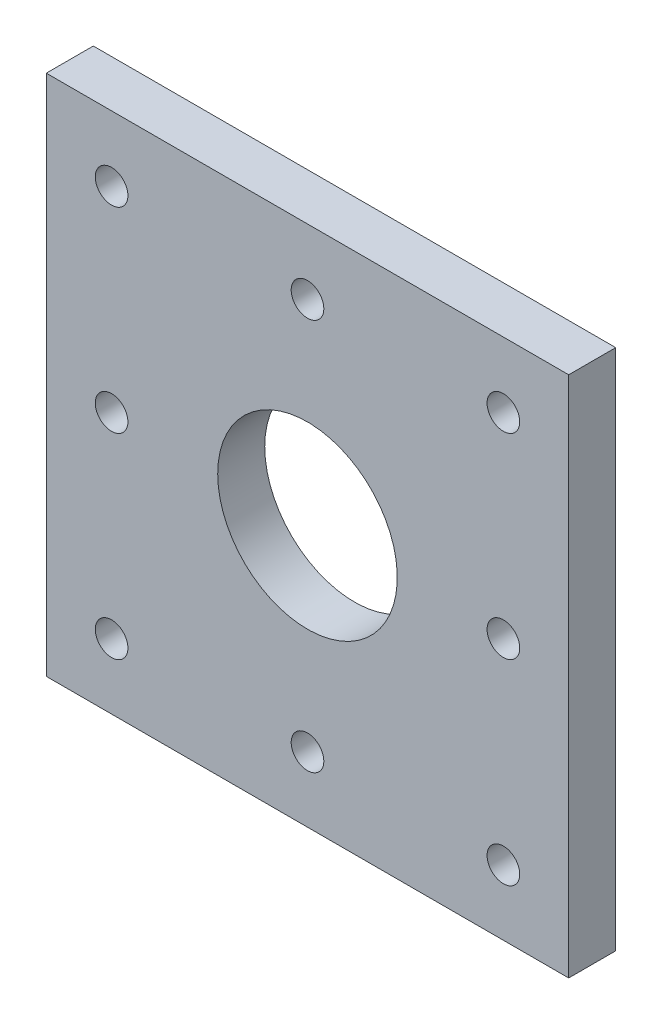
ISO-10303-21;
HEADER;
FILE_DESCRIPTION(('STEP AP214'),'2;1');
FILE_NAME('part.step','',(''),(''),'','','');
FILE_SCHEMA(('AUTOMOTIVE_DESIGN { 1 0 10303 214 1 1 1 1 }'));
ENDSEC;
DATA;
#1=APPLICATION_CONTEXT('core data for automotive mechanical design processes');
#2=APPLICATION_PROTOCOL_DEFINITION('international standard','automotive_design',2000,#1);
#3=PRODUCT_CONTEXT('',#1,'mechanical');
#4=PRODUCT('Part','Part','',(#3));
#5=PRODUCT_RELATED_PRODUCT_CATEGORY('part','',(#4));
#6=PRODUCT_DEFINITION_FORMATION('','',#4);
#7=PRODUCT_DEFINITION_CONTEXT('part definition',#1,'design');
#8=PRODUCT_DEFINITION('design','',#6,#7);
#9=PRODUCT_DEFINITION_SHAPE('','',#8);
#10=(LENGTH_UNIT() NAMED_UNIT(*) SI_UNIT(.MILLI.,.METRE.));
#11=(NAMED_UNIT(*) PLANE_ANGLE_UNIT() SI_UNIT($,.RADIAN.));
#12=(NAMED_UNIT(*) SI_UNIT($,.STERADIAN.) SOLID_ANGLE_UNIT());
#13=UNCERTAINTY_MEASURE_WITH_UNIT(LENGTH_MEASURE(1.E-05),#10,'distance_accuracy_value','');
#14=(GEOMETRIC_REPRESENTATION_CONTEXT(3) GLOBAL_UNCERTAINTY_ASSIGNED_CONTEXT((#13)) GLOBAL_UNIT_ASSIGNED_CONTEXT((#10,
#11,#12)) REPRESENTATION_CONTEXT('',''));
#15=CARTESIAN_POINT('',(0.,0.,0.));
#16=DIRECTION('',(0.,0.,1.));
#17=DIRECTION('',(1.,0.,0.));
#18=AXIS2_PLACEMENT_3D('',#15,#16,#17);
#19=CARTESIAN_POINT('',(0.,0.,4.572));
#20=DIRECTION('',(1.,0.,0.));
#21=DIRECTION('',(0.,1.,0.));
#22=AXIS2_PLACEMENT_3D('',#19,#20,#21);
#23=PLANE('',#22);
#24=DIRECTION('',(0.,-1.,0.));
#25=VECTOR('',#24,1.);
#26=CARTESIAN_POINT('',(0.,0.,0.));
#27=LINE('',#26,#25);
#28=CARTESIAN_POINT('',(0.,50.8,0.));
#29=VERTEX_POINT('',#28);
#30=CARTESIAN_POINT('',(0.,0.,0.));
#31=VERTEX_POINT('',#30);
#32=EDGE_CURVE('E98',#29,#31,#27,.T.);
#33=ORIENTED_EDGE('',*,*,#32,.T.);
#34=DIRECTION('',(0.,0.,-1.));
#35=VECTOR('',#34,1.);
#36=CARTESIAN_POINT('',(0.,0.,4.572));
#37=LINE('',#36,#35);
#38=CARTESIAN_POINT('',(0.,0.,4.572));
#39=VERTEX_POINT('',#38);
#40=EDGE_CURVE('E11',#39,#31,#37,.T.);
#41=ORIENTED_EDGE('',*,*,#40,.F.);
#42=DIRECTION('',(0.,-1.,0.));
#43=VECTOR('',#42,1.);
#44=CARTESIAN_POINT('',(0.,0.,4.572));
#45=LINE('',#44,#43);
#46=CARTESIAN_POINT('',(0.,50.8,4.572));
#47=VERTEX_POINT('',#46);
#48=EDGE_CURVE('E86',#47,#39,#45,.T.);
#49=ORIENTED_EDGE('',*,*,#48,.F.);
#50=DIRECTION('',(0.,0.,-1.));
#51=VECTOR('',#50,1.);
#52=CARTESIAN_POINT('',(0.,50.8,4.572));
#53=LINE('',#52,#51);
#54=EDGE_CURVE('E94',#47,#29,#53,.T.);
#55=ORIENTED_EDGE('',*,*,#54,.T.);
#56=EDGE_LOOP('',(#33,#41,#49,#55));
#57=FACE_BOUND('',#56,.T.);
#58=ADVANCED_FACE('F35',(#57),#23,.F.);
#59=CARTESIAN_POINT('',(0.,0.,4.572));
#60=DIRECTION('',(0.,1.,0.));
#61=DIRECTION('',(0.,0.,1.));
#62=AXIS2_PLACEMENT_3D('',#59,#60,#61);
#63=PLANE('',#62);
#64=DIRECTION('',(1.,0.,0.));
#65=VECTOR('',#64,1.);
#66=CARTESIAN_POINT('',(0.,0.,0.));
#67=LINE('',#66,#65);
#68=CARTESIAN_POINT('',(50.8,0.,0.));
#69=VERTEX_POINT('',#68);
#70=EDGE_CURVE('E90',#31,#69,#67,.T.);
#71=ORIENTED_EDGE('',*,*,#70,.T.);
#72=DIRECTION('',(0.,0.,-1.));
#73=VECTOR('',#72,1.);
#74=CARTESIAN_POINT('',(50.8,0.,4.572));
#75=LINE('',#74,#73);
#76=CARTESIAN_POINT('',(50.8,0.,4.572));
#77=VERTEX_POINT('',#76);
#78=EDGE_CURVE('E43',#77,#69,#75,.T.);
#79=ORIENTED_EDGE('',*,*,#78,.F.);
#80=DIRECTION('',(1.,0.,0.));
#81=VECTOR('',#80,1.);
#82=CARTESIAN_POINT('',(0.,0.,4.572));
#83=LINE('',#82,#81);
#84=EDGE_CURVE('E81',#39,#77,#83,.T.);
#85=ORIENTED_EDGE('',*,*,#84,.F.);
#86=ORIENTED_EDGE('',*,*,#40,.T.);
#87=EDGE_LOOP('',(#71,#79,#85,#86));
#88=FACE_BOUND('',#87,.T.);
#89=ADVANCED_FACE('F89',(#88),#63,.F.);
#90=CARTESIAN_POINT('',(50.8,0.,4.572));
#91=DIRECTION('',(-1.,0.,0.));
#92=DIRECTION('',(0.,-1.,0.));
#93=AXIS2_PLACEMENT_3D('',#90,#91,#92);
#94=PLANE('',#93);
#95=DIRECTION('',(0.,1.,0.));
#96=VECTOR('',#95,1.);
#97=CARTESIAN_POINT('',(50.8,0.,0.));
#98=LINE('',#97,#96);
#99=CARTESIAN_POINT('',(50.8,50.8,0.));
#100=VERTEX_POINT('',#99);
#101=EDGE_CURVE('E68',#69,#100,#98,.T.);
#102=ORIENTED_EDGE('',*,*,#101,.T.);
#103=DIRECTION('',(0.,0.,-1.));
#104=VECTOR('',#103,1.);
#105=CARTESIAN_POINT('',(50.8,50.8,4.572));
#106=LINE('',#105,#104);
#107=CARTESIAN_POINT('',(50.8,50.8,4.572));
#108=VERTEX_POINT('',#107);
#109=EDGE_CURVE('E91',#108,#100,#106,.T.);
#110=ORIENTED_EDGE('',*,*,#109,.F.);
#111=DIRECTION('',(0.,1.,0.));
#112=VECTOR('',#111,1.);
#113=CARTESIAN_POINT('',(50.8,0.,4.572));
#114=LINE('',#113,#112);
#115=EDGE_CURVE('E84',#77,#108,#114,.T.);
#116=ORIENTED_EDGE('',*,*,#115,.F.);
#117=ORIENTED_EDGE('',*,*,#78,.T.);
#118=EDGE_LOOP('',(#102,#110,#116,#117));
#119=FACE_BOUND('',#118,.T.);
#120=ADVANCED_FACE('F92',(#119),#94,.F.);
#121=CARTESIAN_POINT('',(0.,50.8,4.572));
#122=DIRECTION('',(0.,-1.,0.));
#123=DIRECTION('',(0.,0.,-1.));
#124=AXIS2_PLACEMENT_3D('',#121,#122,#123);
#125=PLANE('',#124);
#126=DIRECTION('',(-1.,0.,0.));
#127=VECTOR('',#126,1.);
#128=CARTESIAN_POINT('',(0.,50.8,0.));
#129=LINE('',#128,#127);
#130=EDGE_CURVE('E74',#100,#29,#129,.T.);
#131=ORIENTED_EDGE('',*,*,#130,.T.);
#132=ORIENTED_EDGE('',*,*,#54,.F.);
#133=DIRECTION('',(-1.,0.,0.));
#134=VECTOR('',#133,1.);
#135=CARTESIAN_POINT('',(0.,50.8,4.572));
#136=LINE('',#135,#134);
#137=EDGE_CURVE('E51',#108,#47,#136,.T.);
#138=ORIENTED_EDGE('',*,*,#137,.F.);
#139=ORIENTED_EDGE('',*,*,#109,.T.);
#140=EDGE_LOOP('',(#131,#132,#138,#139));
#141=FACE_BOUND('',#140,.T.);
#142=ADVANCED_FACE('F106',(#141),#125,.F.);
#143=CARTESIAN_POINT('',(0.,50.8,4.572));
#144=DIRECTION('',(0.,0.,-1.));
#145=DIRECTION('',(-1.,0.,0.));
#146=AXIS2_PLACEMENT_3D('',#143,#144,#145);
#147=PLANE('',#146);
#148=CARTESIAN_POINT('',(6.34999999999961,44.4500000000001,4.572));
#149=DIRECTION('',(0.,0.,-1.));
#150=DIRECTION('',(-1.,0.,0.));
#151=AXIS2_PLACEMENT_3D('',#148,#149,#150);
#152=CIRCLE('',#151,1.58749999999905);
#153=CARTESIAN_POINT('',(4.76250000000056,44.4500000000001,4.572));
#154=VERTEX_POINT('',#153);
#155=EDGE_CURVE('E157',#154,#154,#152,.T.);
#156=ORIENTED_EDGE('',*,*,#155,.T.);
#157=EDGE_LOOP('',(#156));
#158=FACE_BOUND('',#157,.T.);
#159=CARTESIAN_POINT('',(44.4499999999996,44.4500000000001,4.572));
#160=DIRECTION('',(0.,0.,-1.));
#161=DIRECTION('',(-1.,0.,0.));
#162=AXIS2_PLACEMENT_3D('',#159,#160,#161);
#163=CIRCLE('',#162,1.58749999999929);
#164=CARTESIAN_POINT('',(42.8625000000003,44.4500000000001,4.572));
#165=VERTEX_POINT('',#164);
#166=EDGE_CURVE('E151',#165,#165,#163,.T.);
#167=ORIENTED_EDGE('',*,*,#166,.T.);
#168=EDGE_LOOP('',(#167));
#169=FACE_BOUND('',#168,.T.);
#170=CARTESIAN_POINT('',(44.4499999999981,6.35000000000019,4.572));
#171=DIRECTION('',(0.,0.,-1.));
#172=DIRECTION('',(-1.,0.,0.));
#173=AXIS2_PLACEMENT_3D('',#170,#171,#172);
#174=CIRCLE('',#173,1.58749999999839);
#175=CARTESIAN_POINT('',(42.8624999999998,6.35000000000019,4.572));
#176=VERTEX_POINT('',#175);
#177=EDGE_CURVE('E145',#176,#176,#174,.T.);
#178=ORIENTED_EDGE('',*,*,#177,.T.);
#179=EDGE_LOOP('',(#178));
#180=FACE_BOUND('',#179,.T.);
#181=CARTESIAN_POINT('',(6.34999999999961,6.35000000000011,4.572));
#182=DIRECTION('',(0.,0.,-1.));
#183=DIRECTION('',(-1.,0.,0.));
#184=AXIS2_PLACEMENT_3D('',#181,#182,#183);
#185=CIRCLE('',#184,1.58749999999927);
#186=CARTESIAN_POINT('',(4.76250000000034,6.35000000000011,4.572));
#187=VERTEX_POINT('',#186);
#188=EDGE_CURVE('E139',#187,#187,#185,.T.);
#189=ORIENTED_EDGE('',*,*,#188,.T.);
#190=EDGE_LOOP('',(#189));
#191=FACE_BOUND('',#190,.T.);
#192=CARTESIAN_POINT('',(44.45,25.4,4.572));
#193=DIRECTION('',(0.,0.,1.));
#194=DIRECTION('',(1.,0.,0.));
#195=AXIS2_PLACEMENT_3D('',#192,#193,#194);
#196=CIRCLE('',#195,1.5875);
#197=CARTESIAN_POINT('',(46.0375,25.4,4.572));
#198=VERTEX_POINT('',#197);
#199=EDGE_CURVE('E136',#198,#198,#196,.T.);
#200=ORIENTED_EDGE('',*,*,#199,.F.);
#201=EDGE_LOOP('',(#200));
#202=FACE_BOUND('',#201,.T.);
#203=CARTESIAN_POINT('',(25.4,44.45,4.572));
#204=DIRECTION('',(0.,0.,1.));
#205=DIRECTION('',(1.,0.,0.));
#206=AXIS2_PLACEMENT_3D('',#203,#204,#205);
#207=CIRCLE('',#206,1.5875);
#208=CARTESIAN_POINT('',(26.9875,44.45,4.572));
#209=VERTEX_POINT('',#208);
#210=EDGE_CURVE('E130',#209,#209,#207,.T.);
#211=ORIENTED_EDGE('',*,*,#210,.F.);
#212=EDGE_LOOP('',(#211));
#213=FACE_BOUND('',#212,.T.);
#214=CARTESIAN_POINT('',(6.35,25.4,4.572));
#215=DIRECTION('',(0.,0.,1.));
#216=DIRECTION('',(1.,0.,0.));
#217=AXIS2_PLACEMENT_3D('',#214,#215,#216);
#218=CIRCLE('',#217,1.5875);
#219=CARTESIAN_POINT('',(7.9375,25.4,4.572));
#220=VERTEX_POINT('',#219);
#221=EDGE_CURVE('E124',#220,#220,#218,.T.);
#222=ORIENTED_EDGE('',*,*,#221,.F.);
#223=EDGE_LOOP('',(#222));
#224=FACE_BOUND('',#223,.T.);
#225=CARTESIAN_POINT('',(25.4,6.35,4.572));
#226=DIRECTION('',(0.,0.,1.));
#227=DIRECTION('',(1.,0.,0.));
#228=AXIS2_PLACEMENT_3D('',#225,#226,#227);
#229=CIRCLE('',#228,1.5875);
#230=CARTESIAN_POINT('',(26.9875,6.35,4.572));
#231=VERTEX_POINT('',#230);
#232=EDGE_CURVE('E118',#231,#231,#229,.T.);
#233=ORIENTED_EDGE('',*,*,#232,.F.);
#234=EDGE_LOOP('',(#233));
#235=FACE_BOUND('',#234,.T.);
#236=CARTESIAN_POINT('',(25.4,25.4,4.572));
#237=DIRECTION('',(0.,0.,-1.));
#238=DIRECTION('',(-1.,0.,0.));
#239=AXIS2_PLACEMENT_3D('',#236,#237,#238);
#240=CIRCLE('',#239,8.73125);
#241=CARTESIAN_POINT('',(16.66875,25.4,4.572));
#242=VERTEX_POINT('',#241);
#243=EDGE_CURVE('E101',#242,#242,#240,.T.);
#244=ORIENTED_EDGE('',*,*,#243,.T.);
#245=EDGE_LOOP('',(#244));
#246=FACE_BOUND('',#245,.T.);
#247=ORIENTED_EDGE('',*,*,#48,.T.);
#248=ORIENTED_EDGE('',*,*,#84,.T.);
#249=ORIENTED_EDGE('',*,*,#115,.T.);
#250=ORIENTED_EDGE('',*,*,#137,.T.);
#251=EDGE_LOOP('',(#247,#248,#249,#250));
#252=FACE_BOUND('',#251,.T.);
#253=ADVANCED_FACE('F82',(#158,#169,#180,#191,#202,#213,#224,#235,#246,#252),#147,.F.);
#254=CARTESIAN_POINT('',(0.,50.8,0.));
#255=DIRECTION('',(0.,0.,-1.));
#256=DIRECTION('',(-1.,0.,0.));
#257=AXIS2_PLACEMENT_3D('',#254,#255,#256);
#258=PLANE('',#257);
#259=CARTESIAN_POINT('',(6.34999999999961,44.4500000000001,0.));
#260=DIRECTION('',(0.,0.,-1.));
#261=DIRECTION('',(-1.,0.,0.));
#262=AXIS2_PLACEMENT_3D('',#259,#260,#261);
#263=CIRCLE('',#262,1.58749999999905);
#264=CARTESIAN_POINT('',(4.76250000000056,44.4500000000001,0.));
#265=VERTEX_POINT('',#264);
#266=EDGE_CURVE('E160',#265,#265,#263,.T.);
#267=ORIENTED_EDGE('',*,*,#266,.F.);
#268=EDGE_LOOP('',(#267));
#269=FACE_BOUND('',#268,.T.);
#270=CARTESIAN_POINT('',(44.4499999999996,44.4500000000001,0.));
#271=DIRECTION('',(0.,0.,-1.));
#272=DIRECTION('',(-1.,0.,0.));
#273=AXIS2_PLACEMENT_3D('',#270,#271,#272);
#274=CIRCLE('',#273,1.58749999999929);
#275=CARTESIAN_POINT('',(42.8625000000003,44.4500000000001,0.));
#276=VERTEX_POINT('',#275);
#277=EDGE_CURVE('E154',#276,#276,#274,.T.);
#278=ORIENTED_EDGE('',*,*,#277,.F.);
#279=EDGE_LOOP('',(#278));
#280=FACE_BOUND('',#279,.T.);
#281=CARTESIAN_POINT('',(44.4499999999981,6.35000000000019,0.));
#282=DIRECTION('',(0.,0.,-1.));
#283=DIRECTION('',(-1.,0.,0.));
#284=AXIS2_PLACEMENT_3D('',#281,#282,#283);
#285=CIRCLE('',#284,1.58749999999839);
#286=CARTESIAN_POINT('',(42.8624999999998,6.35000000000019,0.));
#287=VERTEX_POINT('',#286);
#288=EDGE_CURVE('E148',#287,#287,#285,.T.);
#289=ORIENTED_EDGE('',*,*,#288,.F.);
#290=EDGE_LOOP('',(#289));
#291=FACE_BOUND('',#290,.T.);
#292=CARTESIAN_POINT('',(6.34999999999961,6.35000000000011,0.));
#293=DIRECTION('',(0.,0.,-1.));
#294=DIRECTION('',(-1.,0.,0.));
#295=AXIS2_PLACEMENT_3D('',#292,#293,#294);
#296=CIRCLE('',#295,1.58749999999927);
#297=CARTESIAN_POINT('',(4.76250000000034,6.35000000000011,0.));
#298=VERTEX_POINT('',#297);
#299=EDGE_CURVE('E142',#298,#298,#296,.T.);
#300=ORIENTED_EDGE('',*,*,#299,.F.);
#301=EDGE_LOOP('',(#300));
#302=FACE_BOUND('',#301,.T.);
#303=CARTESIAN_POINT('',(44.45,25.4,0.));
#304=DIRECTION('',(0.,0.,1.));
#305=DIRECTION('',(1.,0.,0.));
#306=AXIS2_PLACEMENT_3D('',#303,#304,#305);
#307=CIRCLE('',#306,1.5875);
#308=CARTESIAN_POINT('',(46.0375,25.4,0.));
#309=VERTEX_POINT('',#308);
#310=EDGE_CURVE('E133',#309,#309,#307,.T.);
#311=ORIENTED_EDGE('',*,*,#310,.T.);
#312=EDGE_LOOP('',(#311));
#313=FACE_BOUND('',#312,.T.);
#314=CARTESIAN_POINT('',(25.4,44.45,0.));
#315=DIRECTION('',(0.,0.,1.));
#316=DIRECTION('',(1.,0.,0.));
#317=AXIS2_PLACEMENT_3D('',#314,#315,#316);
#318=CIRCLE('',#317,1.5875);
#319=CARTESIAN_POINT('',(26.9875,44.45,0.));
#320=VERTEX_POINT('',#319);
#321=EDGE_CURVE('E127',#320,#320,#318,.T.);
#322=ORIENTED_EDGE('',*,*,#321,.T.);
#323=EDGE_LOOP('',(#322));
#324=FACE_BOUND('',#323,.T.);
#325=CARTESIAN_POINT('',(6.35,25.4,0.));
#326=DIRECTION('',(0.,0.,1.));
#327=DIRECTION('',(1.,0.,0.));
#328=AXIS2_PLACEMENT_3D('',#325,#326,#327);
#329=CIRCLE('',#328,1.5875);
#330=CARTESIAN_POINT('',(7.9375,25.4,0.));
#331=VERTEX_POINT('',#330);
#332=EDGE_CURVE('E121',#331,#331,#329,.T.);
#333=ORIENTED_EDGE('',*,*,#332,.T.);
#334=EDGE_LOOP('',(#333));
#335=FACE_BOUND('',#334,.T.);
#336=CARTESIAN_POINT('',(25.4,6.35,0.));
#337=DIRECTION('',(0.,0.,1.));
#338=DIRECTION('',(1.,0.,0.));
#339=AXIS2_PLACEMENT_3D('',#336,#337,#338);
#340=CIRCLE('',#339,1.5875);
#341=CARTESIAN_POINT('',(26.9875,6.35,0.));
#342=VERTEX_POINT('',#341);
#343=EDGE_CURVE('E115',#342,#342,#340,.T.);
#344=ORIENTED_EDGE('',*,*,#343,.T.);
#345=EDGE_LOOP('',(#344));
#346=FACE_BOUND('',#345,.T.);
#347=CARTESIAN_POINT('',(25.4,25.4,0.));
#348=DIRECTION('',(0.,0.,-1.));
#349=DIRECTION('',(-1.,0.,0.));
#350=AXIS2_PLACEMENT_3D('',#347,#348,#349);
#351=CIRCLE('',#350,8.73125);
#352=CARTESIAN_POINT('',(16.66875,25.4,0.));
#353=VERTEX_POINT('',#352);
#354=EDGE_CURVE('E112',#353,#353,#351,.T.);
#355=ORIENTED_EDGE('',*,*,#354,.F.);
#356=EDGE_LOOP('',(#355));
#357=FACE_BOUND('',#356,.T.);
#358=ORIENTED_EDGE('',*,*,#32,.F.);
#359=ORIENTED_EDGE('',*,*,#130,.F.);
#360=ORIENTED_EDGE('',*,*,#101,.F.);
#361=ORIENTED_EDGE('',*,*,#70,.F.);
#362=EDGE_LOOP('',(#358,#359,#360,#361));
#363=FACE_BOUND('',#362,.T.);
#364=ADVANCED_FACE('F109',(#269,#280,#291,#302,#313,#324,#335,#346,#357,#363),#258,.T.);
#365=CARTESIAN_POINT('',(25.4,25.4,4.572));
#366=DIRECTION('',(0.,0.,-1.));
#367=DIRECTION('',(-1.,0.,0.));
#368=AXIS2_PLACEMENT_3D('',#365,#366,#367);
#369=CYLINDRICAL_SURFACE('',#368,8.73125);
#370=ORIENTED_EDGE('',*,*,#243,.F.);
#371=EDGE_LOOP('',(#370));
#372=FACE_BOUND('',#371,.T.);
#373=ORIENTED_EDGE('',*,*,#354,.T.);
#374=EDGE_LOOP('',(#373));
#375=FACE_BOUND('',#374,.T.);
#376=ADVANCED_FACE('F177',(#372,#375),#369,.F.);
#377=CARTESIAN_POINT('',(25.4,6.35,0.));
#378=DIRECTION('',(0.,0.,1.));
#379=DIRECTION('',(1.,0.,0.));
#380=AXIS2_PLACEMENT_3D('',#377,#378,#379);
#381=CYLINDRICAL_SURFACE('',#380,1.5875);
#382=ORIENTED_EDGE('',*,*,#343,.F.);
#383=EDGE_LOOP('',(#382));
#384=FACE_BOUND('',#383,.T.);
#385=ORIENTED_EDGE('',*,*,#232,.T.);
#386=EDGE_LOOP('',(#385));
#387=FACE_BOUND('',#386,.T.);
#388=ADVANCED_FACE('F196',(#384,#387),#381,.F.);
#389=CARTESIAN_POINT('',(6.35,25.4,0.));
#390=DIRECTION('',(0.,0.,1.));
#391=DIRECTION('',(1.,0.,0.));
#392=AXIS2_PLACEMENT_3D('',#389,#390,#391);
#393=CYLINDRICAL_SURFACE('',#392,1.5875);
#394=ORIENTED_EDGE('',*,*,#332,.F.);
#395=EDGE_LOOP('',(#394));
#396=FACE_BOUND('',#395,.T.);
#397=ORIENTED_EDGE('',*,*,#221,.T.);
#398=EDGE_LOOP('',(#397));
#399=FACE_BOUND('',#398,.T.);
#400=ADVANCED_FACE('F202',(#396,#399),#393,.F.);
#401=CARTESIAN_POINT('',(25.4,44.45,0.));
#402=DIRECTION('',(0.,0.,1.));
#403=DIRECTION('',(1.,0.,0.));
#404=AXIS2_PLACEMENT_3D('',#401,#402,#403);
#405=CYLINDRICAL_SURFACE('',#404,1.5875);
#406=ORIENTED_EDGE('',*,*,#321,.F.);
#407=EDGE_LOOP('',(#406));
#408=FACE_BOUND('',#407,.T.);
#409=ORIENTED_EDGE('',*,*,#210,.T.);
#410=EDGE_LOOP('',(#409));
#411=FACE_BOUND('',#410,.T.);
#412=ADVANCED_FACE('F267',(#408,#411),#405,.F.);
#413=CARTESIAN_POINT('',(44.45,25.4,0.));
#414=DIRECTION('',(0.,0.,1.));
#415=DIRECTION('',(1.,0.,0.));
#416=AXIS2_PLACEMENT_3D('',#413,#414,#415);
#417=CYLINDRICAL_SURFACE('',#416,1.5875);
#418=ORIENTED_EDGE('',*,*,#310,.F.);
#419=EDGE_LOOP('',(#418));
#420=FACE_BOUND('',#419,.T.);
#421=ORIENTED_EDGE('',*,*,#199,.T.);
#422=EDGE_LOOP('',(#421));
#423=FACE_BOUND('',#422,.T.);
#424=ADVANCED_FACE('F276',(#420,#423),#417,.F.);
#425=CARTESIAN_POINT('',(6.34999999999961,6.35000000000011,4.572));
#426=DIRECTION('',(0.,0.,-1.));
#427=DIRECTION('',(-1.,0.,0.));
#428=AXIS2_PLACEMENT_3D('',#425,#426,#427);
#429=CYLINDRICAL_SURFACE('',#428,1.58749999999927);
#430=ORIENTED_EDGE('',*,*,#188,.F.);
#431=EDGE_LOOP('',(#430));
#432=FACE_BOUND('',#431,.T.);
#433=ORIENTED_EDGE('',*,*,#299,.T.);
#434=EDGE_LOOP('',(#433));
#435=FACE_BOUND('',#434,.T.);
#436=ADVANCED_FACE('F285',(#432,#435),#429,.F.);
#437=CARTESIAN_POINT('',(44.4499999999981,6.35000000000019,4.572));
#438=DIRECTION('',(0.,0.,-1.));
#439=DIRECTION('',(-1.,0.,0.));
#440=AXIS2_PLACEMENT_3D('',#437,#438,#439);
#441=CYLINDRICAL_SURFACE('',#440,1.58749999999839);
#442=ORIENTED_EDGE('',*,*,#177,.F.);
#443=EDGE_LOOP('',(#442));
#444=FACE_BOUND('',#443,.T.);
#445=ORIENTED_EDGE('',*,*,#288,.T.);
#446=EDGE_LOOP('',(#445));
#447=FACE_BOUND('',#446,.T.);
#448=ADVANCED_FACE('F295',(#444,#447),#441,.F.);
#449=CARTESIAN_POINT('',(44.4499999999996,44.4500000000001,4.572));
#450=DIRECTION('',(0.,0.,-1.));
#451=DIRECTION('',(-1.,0.,0.));
#452=AXIS2_PLACEMENT_3D('',#449,#450,#451);
#453=CYLINDRICAL_SURFACE('',#452,1.58749999999929);
#454=ORIENTED_EDGE('',*,*,#166,.F.);
#455=EDGE_LOOP('',(#454));
#456=FACE_BOUND('',#455,.T.);
#457=ORIENTED_EDGE('',*,*,#277,.T.);
#458=EDGE_LOOP('',(#457));
#459=FACE_BOUND('',#458,.T.);
#460=ADVANCED_FACE('F171',(#456,#459),#453,.F.);
#461=CARTESIAN_POINT('',(6.34999999999961,44.4500000000001,4.572));
#462=DIRECTION('',(0.,0.,-1.));
#463=DIRECTION('',(-1.,0.,0.));
#464=AXIS2_PLACEMENT_3D('',#461,#462,#463);
#465=CYLINDRICAL_SURFACE('',#464,1.58749999999905);
#466=ORIENTED_EDGE('',*,*,#155,.F.);
#467=EDGE_LOOP('',(#466));
#468=FACE_BOUND('',#467,.T.);
#469=ORIENTED_EDGE('',*,*,#266,.T.);
#470=EDGE_LOOP('',(#469));
#471=FACE_BOUND('',#470,.T.);
#472=ADVANCED_FACE('F168',(#468,#471),#465,.F.);
#473=CLOSED_SHELL('',(#58,#89,#120,#142,#253,#364,#376,#388,#400,#412,#424,#436,#448,#460,#472));
#474=MANIFOLD_SOLID_BREP('B2',#473);
#475=ADVANCED_BREP_SHAPE_REPRESENTATION('',(#18,#474),#14);
#476=SHAPE_DEFINITION_REPRESENTATION(#9,#475);
ENDSEC;
END-ISO-10303-21;
